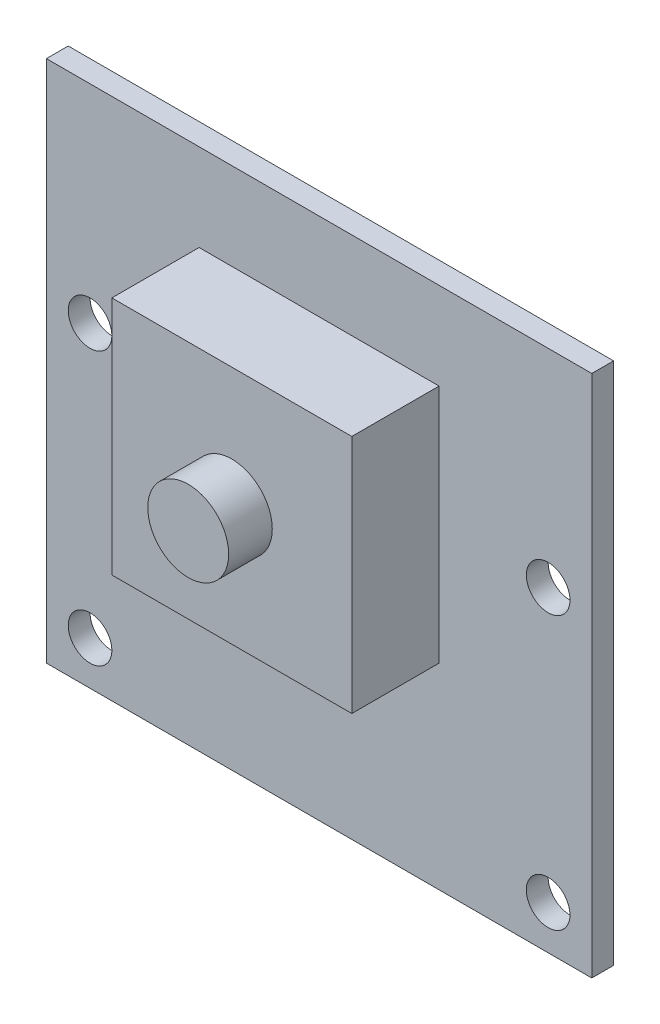
ISO-10303-21;
HEADER;
FILE_DESCRIPTION(('STEP AP214'),'2;1');
FILE_NAME('part.step','',(''),(''),'','','');
FILE_SCHEMA(('AUTOMOTIVE_DESIGN { 1 0 10303 214 1 1 1 1 }'));
ENDSEC;
DATA;
#1=APPLICATION_CONTEXT('core data for automotive mechanical design processes');
#2=APPLICATION_PROTOCOL_DEFINITION('international standard','automotive_design',2000,#1);
#3=PRODUCT_CONTEXT('',#1,'mechanical');
#4=PRODUCT('Part','Part','',(#3));
#5=PRODUCT_RELATED_PRODUCT_CATEGORY('part','',(#4));
#6=PRODUCT_DEFINITION_FORMATION('','',#4);
#7=PRODUCT_DEFINITION_CONTEXT('part definition',#1,'design');
#8=PRODUCT_DEFINITION('design','',#6,#7);
#9=PRODUCT_DEFINITION_SHAPE('','',#8);
#10=(LENGTH_UNIT() NAMED_UNIT(*) SI_UNIT(.MILLI.,.METRE.));
#11=(NAMED_UNIT(*) PLANE_ANGLE_UNIT() SI_UNIT($,.RADIAN.));
#12=(NAMED_UNIT(*) SI_UNIT($,.STERADIAN.) SOLID_ANGLE_UNIT());
#13=UNCERTAINTY_MEASURE_WITH_UNIT(LENGTH_MEASURE(1.E-05),#10,'distance_accuracy_value','');
#14=(GEOMETRIC_REPRESENTATION_CONTEXT(3) GLOBAL_UNCERTAINTY_ASSIGNED_CONTEXT((#13)) GLOBAL_UNIT_ASSIGNED_CONTEXT((#10,
#11,#12)) REPRESENTATION_CONTEXT('',''));
#15=CARTESIAN_POINT('',(0.,0.,0.));
#16=DIRECTION('',(0.,0.,1.));
#17=DIRECTION('',(1.,0.,0.));
#18=AXIS2_PLACEMENT_3D('',#15,#16,#17);
#19=CARTESIAN_POINT('',(0.,0.,1.));
#20=DIRECTION('',(0.,0.,-1.));
#21=DIRECTION('',(-1.,0.,0.));
#22=AXIS2_PLACEMENT_3D('',#19,#20,#21);
#23=PLANE('',#22);
#24=CARTESIAN_POINT('',(23.,14.5,1.));
#25=DIRECTION('',(0.,0.,1.));
#26=DIRECTION('',(1.,0.,0.));
#27=AXIS2_PLACEMENT_3D('',#24,#25,#26);
#28=CIRCLE('',#27,1.);
#29=CARTESIAN_POINT('',(24.,14.5,1.));
#30=VERTEX_POINT('',#29);
#31=EDGE_CURVE('E126',#30,#30,#28,.T.);
#32=ORIENTED_EDGE('',*,*,#31,.F.);
#33=EDGE_LOOP('',(#32));
#34=FACE_BOUND('',#33,.T.);
#35=CARTESIAN_POINT('',(2.,14.5,1.));
#36=DIRECTION('',(0.,0.,1.));
#37=DIRECTION('',(1.,0.,0.));
#38=AXIS2_PLACEMENT_3D('',#35,#36,#37);
#39=CIRCLE('',#38,1.);
#40=CARTESIAN_POINT('',(3.,14.5,1.));
#41=VERTEX_POINT('',#40);
#42=EDGE_CURVE('E140',#41,#41,#39,.T.);
#43=ORIENTED_EDGE('',*,*,#42,.F.);
#44=EDGE_LOOP('',(#43));
#45=FACE_BOUND('',#44,.T.);
#46=CARTESIAN_POINT('',(23.,2.,1.));
#47=DIRECTION('',(0.,0.,1.));
#48=DIRECTION('',(1.,0.,0.));
#49=AXIS2_PLACEMENT_3D('',#46,#47,#48);
#50=CIRCLE('',#49,1.);
#51=CARTESIAN_POINT('',(24.,2.,1.));
#52=VERTEX_POINT('',#51);
#53=EDGE_CURVE('E141',#52,#52,#50,.T.);
#54=ORIENTED_EDGE('',*,*,#53,.F.);
#55=EDGE_LOOP('',(#54));
#56=FACE_BOUND('',#55,.T.);
#57=CARTESIAN_POINT('',(2.,2.,1.));
#58=DIRECTION('',(0.,0.,1.));
#59=DIRECTION('',(1.,0.,0.));
#60=AXIS2_PLACEMENT_3D('',#57,#58,#59);
#61=CIRCLE('',#60,1.);
#62=CARTESIAN_POINT('',(3.,2.,1.));
#63=VERTEX_POINT('',#62);
#64=EDGE_CURVE('E149',#63,#63,#61,.T.);
#65=ORIENTED_EDGE('',*,*,#64,.F.);
#66=EDGE_LOOP('',(#65));
#67=FACE_BOUND('',#66,.T.);
#68=DIRECTION('',(0.,-1.,0.));
#69=VECTOR('',#68,1.);
#70=CARTESIAN_POINT('',(0.,0.,1.));
#71=LINE('',#70,#69);
#72=CARTESIAN_POINT('',(0.,24.,1.));
#73=VERTEX_POINT('',#72);
#74=CARTESIAN_POINT('',(0.,0.,1.));
#75=VERTEX_POINT('',#74);
#76=EDGE_CURVE('E154',#73,#75,#71,.T.);
#77=ORIENTED_EDGE('',*,*,#76,.T.);
#78=DIRECTION('',(1.,0.,0.));
#79=VECTOR('',#78,1.);
#80=CARTESIAN_POINT('',(0.,0.,1.));
#81=LINE('',#80,#79);
#82=CARTESIAN_POINT('',(25.,0.,1.));
#83=VERTEX_POINT('',#82);
#84=EDGE_CURVE('E158',#75,#83,#81,.T.);
#85=ORIENTED_EDGE('',*,*,#84,.T.);
#86=DIRECTION('',(0.,1.,0.));
#87=VECTOR('',#86,1.);
#88=CARTESIAN_POINT('',(25.,0.,1.));
#89=LINE('',#88,#87);
#90=CARTESIAN_POINT('',(25.,24.,1.));
#91=VERTEX_POINT('',#90);
#92=EDGE_CURVE('E161',#83,#91,#89,.T.);
#93=ORIENTED_EDGE('',*,*,#92,.T.);
#94=DIRECTION('',(-1.,0.,0.));
#95=VECTOR('',#94,1.);
#96=CARTESIAN_POINT('',(0.,24.,1.));
#97=LINE('',#96,#95);
#98=EDGE_CURVE('E162',#91,#73,#97,.T.);
#99=ORIENTED_EDGE('',*,*,#98,.T.);
#100=EDGE_LOOP('',(#77,#85,#93,#99));
#101=FACE_BOUND('',#100,.T.);
#102=DIRECTION('',(0.,-1.,0.));
#103=VECTOR('',#102,1.);
#104=CARTESIAN_POINT('',(7.,20.,1.));
#105=LINE('',#104,#103);
#106=CARTESIAN_POINT('',(7.,20.,1.));
#107=VERTEX_POINT('',#106);
#108=CARTESIAN_POINT('',(7.,9.,1.));
#109=VERTEX_POINT('',#108);
#110=EDGE_CURVE('E54',#107,#109,#105,.T.);
#111=ORIENTED_EDGE('',*,*,#110,.F.);
#112=DIRECTION('',(-1.,0.,0.));
#113=VECTOR('',#112,1.);
#114=CARTESIAN_POINT('',(7.,20.,1.));
#115=LINE('',#114,#113);
#116=CARTESIAN_POINT('',(18.,20.,1.));
#117=VERTEX_POINT('',#116);
#118=EDGE_CURVE('E56',#117,#107,#115,.T.);
#119=ORIENTED_EDGE('',*,*,#118,.F.);
#120=DIRECTION('',(0.,1.,0.));
#121=VECTOR('',#120,1.);
#122=CARTESIAN_POINT('',(18.,20.,1.));
#123=LINE('',#122,#121);
#124=CARTESIAN_POINT('',(18.,9.00000000000001,1.));
#125=VERTEX_POINT('',#124);
#126=EDGE_CURVE('E363',#125,#117,#123,.T.);
#127=ORIENTED_EDGE('',*,*,#126,.F.);
#128=DIRECTION('',(1.,0.,0.));
#129=VECTOR('',#128,1.);
#130=CARTESIAN_POINT('',(7.,9.,1.));
#131=LINE('',#130,#129);
#132=EDGE_CURVE('E351',#109,#125,#131,.T.);
#133=ORIENTED_EDGE('',*,*,#132,.F.);
#134=EDGE_LOOP('',(#111,#119,#127,#133));
#135=FACE_BOUND('',#134,.T.);
#136=ADVANCED_FACE('F39',(#34,#45,#56,#67,#101,#135),#23,.F.);
#137=CARTESIAN_POINT('',(0.,0.,0.));
#138=DIRECTION('',(0.,0.,-1.));
#139=DIRECTION('',(-1.,0.,0.));
#140=AXIS2_PLACEMENT_3D('',#137,#138,#139);
#141=PLANE('',#140);
#142=CARTESIAN_POINT('',(2.,14.5,0.));
#143=DIRECTION('',(0.,0.,1.));
#144=DIRECTION('',(1.,0.,0.));
#145=AXIS2_PLACEMENT_3D('',#142,#143,#144);
#146=CIRCLE('',#145,1.);
#147=CARTESIAN_POINT('',(3.,14.5,0.));
#148=VERTEX_POINT('',#147);
#149=EDGE_CURVE('E133',#148,#148,#146,.T.);
#150=ORIENTED_EDGE('',*,*,#149,.T.);
#151=EDGE_LOOP('',(#150));
#152=FACE_BOUND('',#151,.T.);
#153=CARTESIAN_POINT('',(2.,2.,0.));
#154=DIRECTION('',(0.,0.,1.));
#155=DIRECTION('',(1.,0.,0.));
#156=AXIS2_PLACEMENT_3D('',#153,#154,#155);
#157=CIRCLE('',#156,1.);
#158=CARTESIAN_POINT('',(3.,2.,0.));
#159=VERTEX_POINT('',#158);
#160=EDGE_CURVE('E148',#159,#159,#157,.T.);
#161=ORIENTED_EDGE('',*,*,#160,.T.);
#162=EDGE_LOOP('',(#161));
#163=FACE_BOUND('',#162,.T.);
#164=DIRECTION('',(0.,-1.,0.));
#165=VECTOR('',#164,1.);
#166=CARTESIAN_POINT('',(0.,0.,0.));
#167=LINE('',#166,#165);
#168=CARTESIAN_POINT('',(0.,24.,0.));
#169=VERTEX_POINT('',#168);
#170=CARTESIAN_POINT('',(0.,0.,0.));
#171=VERTEX_POINT('',#170);
#172=EDGE_CURVE('E155',#169,#171,#167,.T.);
#173=ORIENTED_EDGE('',*,*,#172,.F.);
#174=DIRECTION('',(-1.,0.,0.));
#175=VECTOR('',#174,1.);
#176=CARTESIAN_POINT('',(0.,24.,0.));
#177=LINE('',#176,#175);
#178=CARTESIAN_POINT('',(25.,24.,0.));
#179=VERTEX_POINT('',#178);
#180=EDGE_CURVE('E157',#179,#169,#177,.T.);
#181=ORIENTED_EDGE('',*,*,#180,.F.);
#182=DIRECTION('',(0.,1.,0.));
#183=VECTOR('',#182,1.);
#184=CARTESIAN_POINT('',(25.,0.,0.));
#185=LINE('',#184,#183);
#186=CARTESIAN_POINT('',(25.,0.,0.));
#187=VERTEX_POINT('',#186);
#188=EDGE_CURVE('E168',#187,#179,#185,.T.);
#189=ORIENTED_EDGE('',*,*,#188,.F.);
#190=DIRECTION('',(1.,0.,0.));
#191=VECTOR('',#190,1.);
#192=CARTESIAN_POINT('',(0.,0.,0.));
#193=LINE('',#192,#191);
#194=EDGE_CURVE('E169',#171,#187,#193,.T.);
#195=ORIENTED_EDGE('',*,*,#194,.F.);
#196=EDGE_LOOP('',(#173,#181,#189,#195));
#197=FACE_BOUND('',#196,.T.);
#198=CARTESIAN_POINT('',(23.,2.,0.));
#199=DIRECTION('',(0.,0.,1.));
#200=DIRECTION('',(1.,0.,0.));
#201=AXIS2_PLACEMENT_3D('',#198,#199,#200);
#202=CIRCLE('',#201,1.);
#203=CARTESIAN_POINT('',(24.,2.,0.));
#204=VERTEX_POINT('',#203);
#205=EDGE_CURVE('E137',#204,#204,#202,.T.);
#206=ORIENTED_EDGE('',*,*,#205,.T.);
#207=EDGE_LOOP('',(#206));
#208=FACE_BOUND('',#207,.T.);
#209=CARTESIAN_POINT('',(23.,14.5,0.));
#210=DIRECTION('',(0.,0.,1.));
#211=DIRECTION('',(1.,0.,0.));
#212=AXIS2_PLACEMENT_3D('',#209,#210,#211);
#213=CIRCLE('',#212,1.);
#214=CARTESIAN_POINT('',(24.,14.5,0.));
#215=VERTEX_POINT('',#214);
#216=EDGE_CURVE('E122',#215,#215,#213,.T.);
#217=ORIENTED_EDGE('',*,*,#216,.T.);
#218=EDGE_LOOP('',(#217));
#219=FACE_BOUND('',#218,.T.);
#220=ADVANCED_FACE('F191',(#152,#163,#197,#208,#219),#141,.T.);
#221=CARTESIAN_POINT('',(0.,0.,1.));
#222=DIRECTION('',(1.,0.,0.));
#223=DIRECTION('',(0.,0.,-1.));
#224=AXIS2_PLACEMENT_3D('',#221,#222,#223);
#225=PLANE('',#224);
#226=ORIENTED_EDGE('',*,*,#172,.T.);
#227=DIRECTION('',(0.,0.,-1.));
#228=VECTOR('',#227,1.);
#229=CARTESIAN_POINT('',(0.,0.,1.));
#230=LINE('',#229,#228);
#231=EDGE_CURVE('E43',#75,#171,#230,.T.);
#232=ORIENTED_EDGE('',*,*,#231,.F.);
#233=ORIENTED_EDGE('',*,*,#76,.F.);
#234=DIRECTION('',(0.,0.,-1.));
#235=VECTOR('',#234,1.);
#236=CARTESIAN_POINT('',(0.,24.,1.));
#237=LINE('',#236,#235);
#238=EDGE_CURVE('E164',#73,#169,#237,.T.);
#239=ORIENTED_EDGE('',*,*,#238,.T.);
#240=EDGE_LOOP('',(#226,#232,#233,#239));
#241=FACE_BOUND('',#240,.T.);
#242=ADVANCED_FACE('F41',(#241),#225,.F.);
#243=CARTESIAN_POINT('',(0.,0.,1.));
#244=DIRECTION('',(0.,1.,0.));
#245=DIRECTION('',(0.,0.,1.));
#246=AXIS2_PLACEMENT_3D('',#243,#244,#245);
#247=PLANE('',#246);
#248=ORIENTED_EDGE('',*,*,#194,.T.);
#249=DIRECTION('',(0.,0.,-1.));
#250=VECTOR('',#249,1.);
#251=CARTESIAN_POINT('',(25.,0.,1.));
#252=LINE('',#251,#250);
#253=EDGE_CURVE('E180',#83,#187,#252,.T.);
#254=ORIENTED_EDGE('',*,*,#253,.F.);
#255=ORIENTED_EDGE('',*,*,#84,.F.);
#256=ORIENTED_EDGE('',*,*,#231,.T.);
#257=EDGE_LOOP('',(#248,#254,#255,#256));
#258=FACE_BOUND('',#257,.T.);
#259=ADVANCED_FACE('F187',(#258),#247,.F.);
#260=CARTESIAN_POINT('',(25.,0.,1.));
#261=DIRECTION('',(-1.,0.,0.));
#262=DIRECTION('',(0.,0.,1.));
#263=AXIS2_PLACEMENT_3D('',#260,#261,#262);
#264=PLANE('',#263);
#265=ORIENTED_EDGE('',*,*,#188,.T.);
#266=DIRECTION('',(0.,0.,-1.));
#267=VECTOR('',#266,1.);
#268=CARTESIAN_POINT('',(25.,24.,1.));
#269=LINE('',#268,#267);
#270=EDGE_CURVE('E173',#91,#179,#269,.T.);
#271=ORIENTED_EDGE('',*,*,#270,.F.);
#272=ORIENTED_EDGE('',*,*,#92,.F.);
#273=ORIENTED_EDGE('',*,*,#253,.T.);
#274=EDGE_LOOP('',(#265,#271,#272,#273));
#275=FACE_BOUND('',#274,.T.);
#276=ADVANCED_FACE('F198',(#275),#264,.F.);
#277=CARTESIAN_POINT('',(0.,24.,1.));
#278=DIRECTION('',(0.,-1.,0.));
#279=DIRECTION('',(0.,0.,-1.));
#280=AXIS2_PLACEMENT_3D('',#277,#278,#279);
#281=PLANE('',#280);
#282=ORIENTED_EDGE('',*,*,#180,.T.);
#283=ORIENTED_EDGE('',*,*,#238,.F.);
#284=ORIENTED_EDGE('',*,*,#98,.F.);
#285=ORIENTED_EDGE('',*,*,#270,.T.);
#286=EDGE_LOOP('',(#282,#283,#284,#285));
#287=FACE_BOUND('',#286,.T.);
#288=ADVANCED_FACE('F200',(#287),#281,.F.);
#289=CARTESIAN_POINT('',(2.,2.,1.));
#290=DIRECTION('',(0.,0.,-1.));
#291=DIRECTION('',(-1.,0.,0.));
#292=AXIS2_PLACEMENT_3D('',#289,#290,#291);
#293=CYLINDRICAL_SURFACE('',#292,1.);
#294=ORIENTED_EDGE('',*,*,#64,.T.);
#295=EDGE_LOOP('',(#294));
#296=FACE_BOUND('',#295,.T.);
#297=ORIENTED_EDGE('',*,*,#160,.F.);
#298=EDGE_LOOP('',(#297));
#299=FACE_BOUND('',#298,.T.);
#300=ADVANCED_FACE('F212',(#296,#299),#293,.F.);
#301=CARTESIAN_POINT('',(23.,2.,1.));
#302=DIRECTION('',(0.,0.,-1.));
#303=DIRECTION('',(-1.,0.,0.));
#304=AXIS2_PLACEMENT_3D('',#301,#302,#303);
#305=CYLINDRICAL_SURFACE('',#304,1.);
#306=ORIENTED_EDGE('',*,*,#53,.T.);
#307=EDGE_LOOP('',(#306));
#308=FACE_BOUND('',#307,.T.);
#309=ORIENTED_EDGE('',*,*,#205,.F.);
#310=EDGE_LOOP('',(#309));
#311=FACE_BOUND('',#310,.T.);
#312=ADVANCED_FACE('F254',(#308,#311),#305,.F.);
#313=CARTESIAN_POINT('',(2.,14.5,1.));
#314=DIRECTION('',(0.,0.,-1.));
#315=DIRECTION('',(-1.,0.,0.));
#316=AXIS2_PLACEMENT_3D('',#313,#314,#315);
#317=CYLINDRICAL_SURFACE('',#316,1.);
#318=ORIENTED_EDGE('',*,*,#42,.T.);
#319=EDGE_LOOP('',(#318));
#320=FACE_BOUND('',#319,.T.);
#321=ORIENTED_EDGE('',*,*,#149,.F.);
#322=EDGE_LOOP('',(#321));
#323=FACE_BOUND('',#322,.T.);
#324=ADVANCED_FACE('F263',(#320,#323),#317,.F.);
#325=CARTESIAN_POINT('',(23.,14.5,1.));
#326=DIRECTION('',(0.,0.,-1.));
#327=DIRECTION('',(-1.,0.,0.));
#328=AXIS2_PLACEMENT_3D('',#325,#326,#327);
#329=CYLINDRICAL_SURFACE('',#328,1.);
#330=ORIENTED_EDGE('',*,*,#31,.T.);
#331=EDGE_LOOP('',(#330));
#332=FACE_BOUND('',#331,.T.);
#333=ORIENTED_EDGE('',*,*,#216,.F.);
#334=EDGE_LOOP('',(#333));
#335=FACE_BOUND('',#334,.T.);
#336=ADVANCED_FACE('F271',(#332,#335),#329,.F.);
#337=CARTESIAN_POINT('',(7.,20.,5.));
#338=DIRECTION('',(1.,0.,0.));
#339=DIRECTION('',(0.,0.,-1.));
#340=AXIS2_PLACEMENT_3D('',#337,#338,#339);
#341=PLANE('',#340);
#342=ORIENTED_EDGE('',*,*,#110,.T.);
#343=DIRECTION('',(0.,0.,-1.));
#344=VECTOR('',#343,1.);
#345=CARTESIAN_POINT('',(7.,9.,5.));
#346=LINE('',#345,#344);
#347=CARTESIAN_POINT('',(7.,9.,5.));
#348=VERTEX_POINT('',#347);
#349=EDGE_CURVE('E107',#348,#109,#346,.T.);
#350=ORIENTED_EDGE('',*,*,#349,.F.);
#351=DIRECTION('',(0.,-1.,0.));
#352=VECTOR('',#351,1.);
#353=CARTESIAN_POINT('',(7.,20.,5.));
#354=LINE('',#353,#352);
#355=CARTESIAN_POINT('',(7.,20.,5.));
#356=VERTEX_POINT('',#355);
#357=EDGE_CURVE('E111',#356,#348,#354,.T.);
#358=ORIENTED_EDGE('',*,*,#357,.F.);
#359=DIRECTION('',(0.,0.,-1.));
#360=VECTOR('',#359,1.);
#361=CARTESIAN_POINT('',(7.,20.,5.));
#362=LINE('',#361,#360);
#363=EDGE_CURVE('E356',#356,#107,#362,.T.);
#364=ORIENTED_EDGE('',*,*,#363,.T.);
#365=EDGE_LOOP('',(#342,#350,#358,#364));
#366=FACE_BOUND('',#365,.T.);
#367=ADVANCED_FACE('F124',(#366),#341,.F.);
#368=CARTESIAN_POINT('',(7.,9.,5.));
#369=DIRECTION('',(0.,1.,0.));
#370=DIRECTION('',(-1.,0.,0.));
#371=AXIS2_PLACEMENT_3D('',#368,#369,#370);
#372=PLANE('',#371);
#373=ORIENTED_EDGE('',*,*,#132,.T.);
#374=DIRECTION('',(0.,0.,-1.));
#375=VECTOR('',#374,1.);
#376=CARTESIAN_POINT('',(18.,9.00000000000001,5.));
#377=LINE('',#376,#375);
#378=CARTESIAN_POINT('',(18.,9.00000000000001,5.));
#379=VERTEX_POINT('',#378);
#380=EDGE_CURVE('E109',#379,#125,#377,.T.);
#381=ORIENTED_EDGE('',*,*,#380,.F.);
#382=DIRECTION('',(1.,0.,0.));
#383=VECTOR('',#382,1.);
#384=CARTESIAN_POINT('',(7.,9.,5.));
#385=LINE('',#384,#383);
#386=EDGE_CURVE('E103',#348,#379,#385,.T.);
#387=ORIENTED_EDGE('',*,*,#386,.F.);
#388=ORIENTED_EDGE('',*,*,#349,.T.);
#389=EDGE_LOOP('',(#373,#381,#387,#388));
#390=FACE_BOUND('',#389,.T.);
#391=ADVANCED_FACE('F106',(#390),#372,.F.);
#392=CARTESIAN_POINT('',(18.,20.,5.));
#393=DIRECTION('',(-1.,0.,0.));
#394=DIRECTION('',(0.,0.,1.));
#395=AXIS2_PLACEMENT_3D('',#392,#393,#394);
#396=PLANE('',#395);
#397=ORIENTED_EDGE('',*,*,#126,.T.);
#398=DIRECTION('',(0.,0.,-1.));
#399=VECTOR('',#398,1.);
#400=CARTESIAN_POINT('',(18.,20.,5.));
#401=LINE('',#400,#399);
#402=CARTESIAN_POINT('',(18.,20.,5.));
#403=VERTEX_POINT('',#402);
#404=EDGE_CURVE('E128',#403,#117,#401,.T.);
#405=ORIENTED_EDGE('',*,*,#404,.F.);
#406=DIRECTION('',(0.,1.,0.));
#407=VECTOR('',#406,1.);
#408=CARTESIAN_POINT('',(18.,20.,5.));
#409=LINE('',#408,#407);
#410=EDGE_CURVE('E114',#379,#403,#409,.T.);
#411=ORIENTED_EDGE('',*,*,#410,.F.);
#412=ORIENTED_EDGE('',*,*,#380,.T.);
#413=EDGE_LOOP('',(#397,#405,#411,#412));
#414=FACE_BOUND('',#413,.T.);
#415=ADVANCED_FACE('F300',(#414),#396,.F.);
#416=CARTESIAN_POINT('',(7.,20.,5.));
#417=DIRECTION('',(0.,-1.,0.));
#418=DIRECTION('',(1.,0.,0.));
#419=AXIS2_PLACEMENT_3D('',#416,#417,#418);
#420=PLANE('',#419);
#421=ORIENTED_EDGE('',*,*,#118,.T.);
#422=ORIENTED_EDGE('',*,*,#363,.F.);
#423=DIRECTION('',(-1.,0.,0.));
#424=VECTOR('',#423,1.);
#425=CARTESIAN_POINT('',(7.,20.,5.));
#426=LINE('',#425,#424);
#427=EDGE_CURVE('E116',#403,#356,#426,.T.);
#428=ORIENTED_EDGE('',*,*,#427,.F.);
#429=ORIENTED_EDGE('',*,*,#404,.T.);
#430=EDGE_LOOP('',(#421,#422,#428,#429));
#431=FACE_BOUND('',#430,.T.);
#432=ADVANCED_FACE('F302',(#431),#420,.F.);
#433=CARTESIAN_POINT('',(0.,0.,5.));
#434=DIRECTION('',(0.,0.,1.));
#435=DIRECTION('',(1.,0.,0.));
#436=AXIS2_PLACEMENT_3D('',#433,#434,#435);
#437=PLANE('',#436);
#438=CARTESIAN_POINT('',(12.5,14.5,5.));
#439=DIRECTION('',(0.,0.,1.));
#440=DIRECTION('',(1.,0.,0.));
#441=AXIS2_PLACEMENT_3D('',#438,#439,#440);
#442=CIRCLE('',#441,1.85379574948235);
#443=CARTESIAN_POINT('',(14.3537957494823,14.5,5.));
#444=VERTEX_POINT('',#443);
#445=EDGE_CURVE('E11',#444,#444,#442,.T.);
#446=ORIENTED_EDGE('',*,*,#445,.F.);
#447=EDGE_LOOP('',(#446));
#448=FACE_BOUND('',#447,.T.);
#449=ORIENTED_EDGE('',*,*,#357,.T.);
#450=ORIENTED_EDGE('',*,*,#386,.T.);
#451=ORIENTED_EDGE('',*,*,#410,.T.);
#452=ORIENTED_EDGE('',*,*,#427,.T.);
#453=EDGE_LOOP('',(#449,#450,#451,#452));
#454=FACE_BOUND('',#453,.T.);
#455=ADVANCED_FACE('F120',(#448,#454),#437,.T.);
#456=CARTESIAN_POINT('',(12.5,14.5,7.));
#457=DIRECTION('',(0.,0.,-1.));
#458=DIRECTION('',(-1.,0.,0.));
#459=AXIS2_PLACEMENT_3D('',#456,#457,#458);
#460=CYLINDRICAL_SURFACE('',#459,1.85379574948235);
#461=CARTESIAN_POINT('',(12.5,14.5,7.));
#462=DIRECTION('',(0.,0.,1.));
#463=DIRECTION('',(1.,0.,0.));
#464=AXIS2_PLACEMENT_3D('',#461,#462,#463);
#465=CIRCLE('',#464,1.85379574948235);
#466=CARTESIAN_POINT('',(14.3537957494823,14.5,7.));
#467=VERTEX_POINT('',#466);
#468=EDGE_CURVE('E355',#467,#467,#465,.T.);
#469=ORIENTED_EDGE('',*,*,#468,.F.);
#470=EDGE_LOOP('',(#469));
#471=FACE_BOUND('',#470,.T.);
#472=ORIENTED_EDGE('',*,*,#445,.T.);
#473=EDGE_LOOP('',(#472));
#474=FACE_BOUND('',#473,.T.);
#475=ADVANCED_FACE('F325',(#471,#474),#460,.T.);
#476=CARTESIAN_POINT('',(12.5,14.5,7.));
#477=DIRECTION('',(0.,0.,1.));
#478=DIRECTION('',(1.,0.,0.));
#479=AXIS2_PLACEMENT_3D('',#476,#477,#478);
#480=PLANE('',#479);
#481=ORIENTED_EDGE('',*,*,#468,.T.);
#482=EDGE_LOOP('',(#481));
#483=FACE_BOUND('',#482,.T.);
#484=ADVANCED_FACE('F332',(#483),#480,.T.);
#485=CLOSED_SHELL('',(#136,#220,#242,#259,#276,#288,#300,#312,#324,#336,#367,#391,#415,#432,
#455,#475,#484));
#486=MANIFOLD_SOLID_BREP('B2',#485);
#487=ADVANCED_BREP_SHAPE_REPRESENTATION('',(#18,#486),#14);
#488=SHAPE_DEFINITION_REPRESENTATION(#9,#487);
ENDSEC;
END-ISO-10303-21;
